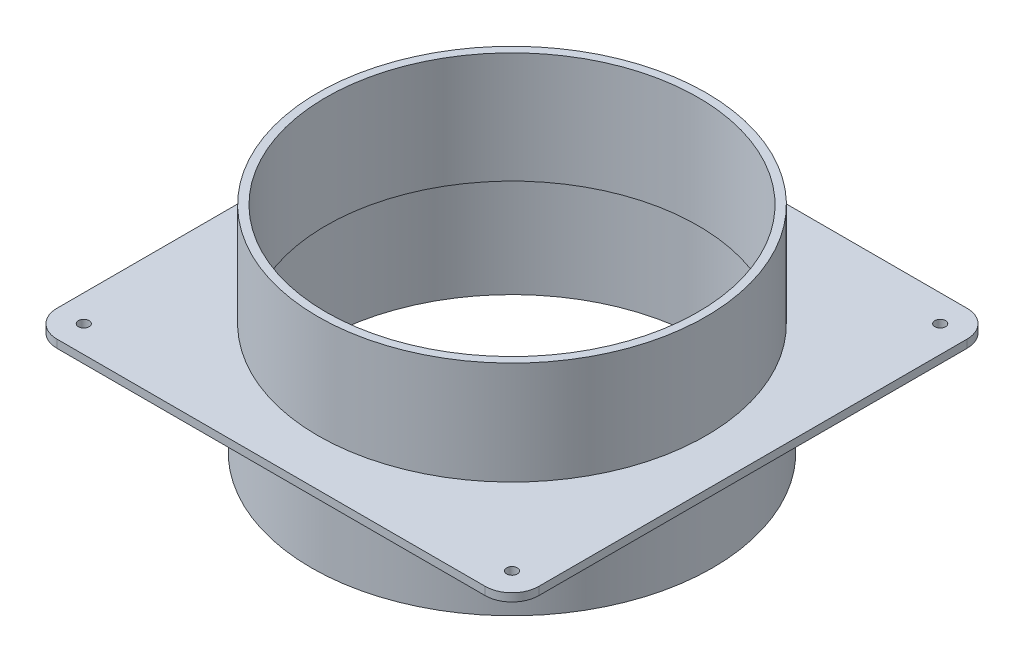
ISO-10303-21;
HEADER;
FILE_DESCRIPTION(('STEP AP214'),'2;1');
FILE_NAME('part.step','',(''),(''),'','','');
FILE_SCHEMA(('AUTOMOTIVE_DESIGN { 1 0 10303 214 1 1 1 1 }'));
ENDSEC;
DATA;
#1=APPLICATION_CONTEXT('core data for automotive mechanical design processes');
#2=APPLICATION_PROTOCOL_DEFINITION('international standard','automotive_design',2000,#1);
#3=PRODUCT_CONTEXT('',#1,'mechanical');
#4=PRODUCT('Part','Part','',(#3));
#5=PRODUCT_RELATED_PRODUCT_CATEGORY('part','',(#4));
#6=PRODUCT_DEFINITION_FORMATION('','',#4);
#7=PRODUCT_DEFINITION_CONTEXT('part definition',#1,'design');
#8=PRODUCT_DEFINITION('design','',#6,#7);
#9=PRODUCT_DEFINITION_SHAPE('','',#8);
#10=(LENGTH_UNIT() NAMED_UNIT(*) SI_UNIT(.MILLI.,.METRE.));
#11=(NAMED_UNIT(*) PLANE_ANGLE_UNIT() SI_UNIT($,.RADIAN.));
#12=(NAMED_UNIT(*) SI_UNIT($,.STERADIAN.) SOLID_ANGLE_UNIT());
#13=UNCERTAINTY_MEASURE_WITH_UNIT(LENGTH_MEASURE(1.E-05),#10,'distance_accuracy_value','');
#14=(GEOMETRIC_REPRESENTATION_CONTEXT(3) GLOBAL_UNCERTAINTY_ASSIGNED_CONTEXT((#13)) GLOBAL_UNIT_ASSIGNED_CONTEXT((#10,
#11,#12)) REPRESENTATION_CONTEXT('',''));
#15=CARTESIAN_POINT('',(0.,0.,0.));
#16=DIRECTION('',(0.,0.,1.));
#17=DIRECTION('',(1.,0.,0.));
#18=AXIS2_PLACEMENT_3D('',#15,#16,#17);
#19=CARTESIAN_POINT('',(0.,-40.,0.));
#20=DIRECTION('',(0.,1.,0.));
#21=DIRECTION('',(0.,0.,1.));
#22=AXIS2_PLACEMENT_3D('',#19,#20,#21);
#23=CYLINDRICAL_SURFACE('',#22,72.);
#24=CARTESIAN_POINT('',(0.,-40.,0.));
#25=DIRECTION('',(0.,1.,0.));
#26=DIRECTION('',(0.,0.,1.));
#27=AXIS2_PLACEMENT_3D('',#24,#25,#26);
#28=CIRCLE('',#27,72.);
#29=CARTESIAN_POINT('',(0.,-40.,72.));
#30=VERTEX_POINT('',#29);
#31=EDGE_CURVE('E19',#30,#30,#28,.F.);
#32=ORIENTED_EDGE('',*,*,#31,.T.);
#33=EDGE_LOOP('',(#32));
#34=FACE_BOUND('',#33,.T.);
#35=CARTESIAN_POINT('',(0.,-1.50000000000006,0.));
#36=DIRECTION('',(0.,1.,0.));
#37=DIRECTION('',(0.,0.,1.));
#38=AXIS2_PLACEMENT_3D('',#35,#36,#37);
#39=CIRCLE('',#38,72.);
#40=CARTESIAN_POINT('',(0.,-1.50000000000006,72.));
#41=VERTEX_POINT('',#40);
#42=EDGE_CURVE('E174',#41,#41,#39,.T.);
#43=ORIENTED_EDGE('',*,*,#42,.T.);
#44=EDGE_LOOP('',(#43));
#45=FACE_BOUND('',#44,.T.);
#46=ADVANCED_FACE('F16',(#34,#45),#23,.F.);
#47=CARTESIAN_POINT('',(0.,-40.,0.));
#48=DIRECTION('',(0.,1.,0.));
#49=DIRECTION('',(0.,0.,1.));
#50=AXIS2_PLACEMENT_3D('',#47,#48,#49);
#51=PLANE('',#50);
#52=CARTESIAN_POINT('',(0.,-40.,0.));
#53=DIRECTION('',(0.,1.,0.));
#54=DIRECTION('',(0.,0.,1.));
#55=AXIS2_PLACEMENT_3D('',#52,#53,#54);
#56=CIRCLE('',#55,75.);
#57=CARTESIAN_POINT('',(0.,-40.,75.));
#58=VERTEX_POINT('',#57);
#59=EDGE_CURVE('E172',#58,#58,#56,.T.);
#60=ORIENTED_EDGE('',*,*,#59,.F.);
#61=EDGE_LOOP('',(#60));
#62=FACE_BOUND('',#61,.T.);
#63=ORIENTED_EDGE('',*,*,#31,.F.);
#64=EDGE_LOOP('',(#63));
#65=FACE_BOUND('',#64,.T.);
#66=ADVANCED_FACE('F182',(#62,#65),#51,.F.);
#67=CARTESIAN_POINT('',(0.,-1.50000000000006,0.));
#68=DIRECTION('',(0.,1.,0.));
#69=DIRECTION('',(0.,0.,1.));
#70=AXIS2_PLACEMENT_3D('',#67,#68,#69);
#71=PLANE('',#70);
#72=ORIENTED_EDGE('',*,*,#42,.F.);
#73=EDGE_LOOP('',(#72));
#74=FACE_BOUND('',#73,.T.);
#75=CARTESIAN_POINT('',(0.,-1.50000000000006,0.));
#76=DIRECTION('',(0.,1.,0.));
#77=DIRECTION('',(0.,0.,1.));
#78=AXIS2_PLACEMENT_3D('',#75,#76,#77);
#79=CIRCLE('',#78,69.5);
#80=CARTESIAN_POINT('',(0.,-1.50000000000006,69.5));
#81=VERTEX_POINT('',#80);
#82=EDGE_CURVE('E169',#81,#81,#79,.T.);
#83=ORIENTED_EDGE('',*,*,#82,.T.);
#84=EDGE_LOOP('',(#83));
#85=FACE_BOUND('',#84,.T.);
#86=ADVANCED_FACE('F184',(#74,#85),#71,.F.);
#87=CARTESIAN_POINT('',(0.,-40.,0.));
#88=DIRECTION('',(0.,1.,0.));
#89=DIRECTION('',(0.,0.,1.));
#90=AXIS2_PLACEMENT_3D('',#87,#88,#89);
#91=CYLINDRICAL_SURFACE('',#90,75.);
#92=CARTESIAN_POINT('',(0.,-1.50000000000006,0.));
#93=DIRECTION('',(0.,1.,0.));
#94=DIRECTION('',(0.,0.,1.));
#95=AXIS2_PLACEMENT_3D('',#92,#93,#94);
#96=CIRCLE('',#95,75.);
#97=CARTESIAN_POINT('',(0.,-1.50000000000006,75.));
#98=VERTEX_POINT('',#97);
#99=EDGE_CURVE('E166',#98,#98,#96,.F.);
#100=ORIENTED_EDGE('',*,*,#99,.T.);
#101=EDGE_LOOP('',(#100));
#102=FACE_BOUND('',#101,.T.);
#103=ORIENTED_EDGE('',*,*,#59,.T.);
#104=EDGE_LOOP('',(#103));
#105=FACE_BOUND('',#104,.T.);
#106=ADVANCED_FACE('F191',(#102,#105),#91,.T.);
#107=CARTESIAN_POINT('',(0.,-1.50000000000006,0.));
#108=DIRECTION('',(0.,1.,0.));
#109=DIRECTION('',(0.,0.,1.));
#110=AXIS2_PLACEMENT_3D('',#107,#108,#109);
#111=CYLINDRICAL_SURFACE('',#110,69.5);
#112=CARTESIAN_POINT('',(0.,40.,0.));
#113=DIRECTION('',(0.,1.,0.));
#114=DIRECTION('',(0.,0.,1.));
#115=AXIS2_PLACEMENT_3D('',#112,#113,#114);
#116=CIRCLE('',#115,69.5);
#117=CARTESIAN_POINT('',(0.,40.,69.5));
#118=VERTEX_POINT('',#117);
#119=EDGE_CURVE('E91',#118,#118,#116,.F.);
#120=ORIENTED_EDGE('',*,*,#119,.F.);
#121=EDGE_LOOP('',(#120));
#122=FACE_BOUND('',#121,.T.);
#123=ORIENTED_EDGE('',*,*,#82,.F.);
#124=EDGE_LOOP('',(#123));
#125=FACE_BOUND('',#124,.T.);
#126=ADVANCED_FACE('F256',(#122,#125),#111,.F.);
#127=CARTESIAN_POINT('',(0.,-1.50000000000006,0.));
#128=DIRECTION('',(0.,1.,0.));
#129=DIRECTION('',(0.,0.,1.));
#130=AXIS2_PLACEMENT_3D('',#127,#128,#129);
#131=PLANE('',#130);
#132=DIRECTION('',(0.,0.,1.));
#133=VECTOR('',#132,1.);
#134=CARTESIAN_POINT('',(90.,-1.50000000000006,0.));
#135=LINE('',#134,#133);
#136=CARTESIAN_POINT('',(90.,-1.50000000000006,-80.));
#137=VERTEX_POINT('',#136);
#138=CARTESIAN_POINT('',(90.,-1.50000000000006,80.));
#139=VERTEX_POINT('',#138);
#140=EDGE_CURVE('E85',#137,#139,#135,.T.);
#141=ORIENTED_EDGE('',*,*,#140,.T.);
#142=CARTESIAN_POINT('',(80.,-1.50000000000006,80.));
#143=DIRECTION('',(0.,1.,0.));
#144=DIRECTION('',(0.,0.,1.));
#145=AXIS2_PLACEMENT_3D('',#142,#143,#144);
#146=CIRCLE('',#145,9.99999999999999);
#147=CARTESIAN_POINT('',(80.,-1.50000000000006,90.));
#148=VERTEX_POINT('',#147);
#149=EDGE_CURVE('E103',#148,#139,#146,.T.);
#150=ORIENTED_EDGE('',*,*,#149,.F.);
#151=DIRECTION('',(-1.,0.,0.));
#152=VECTOR('',#151,1.);
#153=CARTESIAN_POINT('',(0.,-1.50000000000006,90.));
#154=LINE('',#153,#152);
#155=CARTESIAN_POINT('',(-80.,-1.50000000000006,90.));
#156=VERTEX_POINT('',#155);
#157=EDGE_CURVE('E111',#148,#156,#154,.T.);
#158=ORIENTED_EDGE('',*,*,#157,.T.);
#159=CARTESIAN_POINT('',(-80.,-1.50000000000006,80.));
#160=DIRECTION('',(0.,1.,0.));
#161=DIRECTION('',(0.,0.,1.));
#162=AXIS2_PLACEMENT_3D('',#159,#160,#161);
#163=CIRCLE('',#162,9.99999999999999);
#164=CARTESIAN_POINT('',(-90.,-1.50000000000006,80.));
#165=VERTEX_POINT('',#164);
#166=EDGE_CURVE('E114',#165,#156,#163,.T.);
#167=ORIENTED_EDGE('',*,*,#166,.F.);
#168=DIRECTION('',(0.,0.,1.));
#169=VECTOR('',#168,1.);
#170=CARTESIAN_POINT('',(-90.,-1.50000000000006,0.));
#171=LINE('',#170,#169);
#172=CARTESIAN_POINT('',(-90.,-1.50000000000006,-79.9999999999999));
#173=VERTEX_POINT('',#172);
#174=EDGE_CURVE('E115',#173,#165,#171,.T.);
#175=ORIENTED_EDGE('',*,*,#174,.F.);
#176=CARTESIAN_POINT('',(-80.,-1.50000000000006,-80.));
#177=DIRECTION('',(0.,1.,0.));
#178=DIRECTION('',(0.,0.,1.));
#179=AXIS2_PLACEMENT_3D('',#176,#177,#178);
#180=CIRCLE('',#179,9.99999999999999);
#181=CARTESIAN_POINT('',(-80.,-1.50000000000006,-90.));
#182=VERTEX_POINT('',#181);
#183=EDGE_CURVE('E162',#182,#173,#180,.T.);
#184=ORIENTED_EDGE('',*,*,#183,.F.);
#185=DIRECTION('',(-1.,0.,0.));
#186=VECTOR('',#185,1.);
#187=CARTESIAN_POINT('',(0.,-1.50000000000006,-90.));
#188=LINE('',#187,#186);
#189=CARTESIAN_POINT('',(79.9999999999999,-1.50000000000006,-90.));
#190=VERTEX_POINT('',#189);
#191=EDGE_CURVE('E87',#190,#182,#188,.T.);
#192=ORIENTED_EDGE('',*,*,#191,.F.);
#193=CARTESIAN_POINT('',(80.,-1.50000000000006,-80.));
#194=DIRECTION('',(0.,1.,0.));
#195=DIRECTION('',(0.,0.,1.));
#196=AXIS2_PLACEMENT_3D('',#193,#194,#195);
#197=CIRCLE('',#196,9.99999999999999);
#198=EDGE_CURVE('E79',#137,#190,#197,.T.);
#199=ORIENTED_EDGE('',*,*,#198,.F.);
#200=EDGE_LOOP('',(#141,#150,#158,#167,#175,#184,#192,#199));
#201=FACE_BOUND('',#200,.T.);
#202=CARTESIAN_POINT('',(-80.,-1.50000000000006,80.));
#203=DIRECTION('',(0.,1.,0.));
#204=DIRECTION('',(0.,0.,1.));
#205=AXIS2_PLACEMENT_3D('',#202,#203,#204);
#206=CIRCLE('',#205,2.);
#207=CARTESIAN_POINT('',(-80.,-1.50000000000006,82.));
#208=VERTEX_POINT('',#207);
#209=EDGE_CURVE('E100',#208,#208,#206,.T.);
#210=ORIENTED_EDGE('',*,*,#209,.T.);
#211=EDGE_LOOP('',(#210));
#212=FACE_BOUND('',#211,.T.);
#213=CARTESIAN_POINT('',(80.,-1.50000000000006,80.));
#214=DIRECTION('',(0.,1.,0.));
#215=DIRECTION('',(0.,0.,1.));
#216=AXIS2_PLACEMENT_3D('',#213,#214,#215);
#217=CIRCLE('',#216,2.);
#218=CARTESIAN_POINT('',(80.,-1.50000000000006,82.));
#219=VERTEX_POINT('',#218);
#220=EDGE_CURVE('E155',#219,#219,#217,.T.);
#221=ORIENTED_EDGE('',*,*,#220,.T.);
#222=EDGE_LOOP('',(#221));
#223=FACE_BOUND('',#222,.T.);
#224=CARTESIAN_POINT('',(80.,-1.50000000000006,-79.9999999999999));
#225=DIRECTION('',(0.,1.,0.));
#226=DIRECTION('',(0.,0.,1.));
#227=AXIS2_PLACEMENT_3D('',#224,#225,#226);
#228=CIRCLE('',#227,2.);
#229=CARTESIAN_POINT('',(80.,-1.50000000000006,-77.9999999999999));
#230=VERTEX_POINT('',#229);
#231=EDGE_CURVE('E152',#230,#230,#228,.T.);
#232=ORIENTED_EDGE('',*,*,#231,.T.);
#233=EDGE_LOOP('',(#232));
#234=FACE_BOUND('',#233,.T.);
#235=CARTESIAN_POINT('',(-80.,-1.50000000000006,-80.));
#236=DIRECTION('',(0.,1.,0.));
#237=DIRECTION('',(0.,0.,1.));
#238=AXIS2_PLACEMENT_3D('',#235,#236,#237);
#239=CIRCLE('',#238,2.);
#240=CARTESIAN_POINT('',(-80.,-1.50000000000006,-78.));
#241=VERTEX_POINT('',#240);
#242=EDGE_CURVE('E149',#241,#241,#239,.T.);
#243=ORIENTED_EDGE('',*,*,#242,.T.);
#244=EDGE_LOOP('',(#243));
#245=FACE_BOUND('',#244,.T.);
#246=ORIENTED_EDGE('',*,*,#99,.F.);
#247=EDGE_LOOP('',(#246));
#248=FACE_BOUND('',#247,.T.);
#249=ADVANCED_FACE('F81',(#201,#212,#223,#234,#245,#248),#131,.F.);
#250=CARTESIAN_POINT('',(0.,40.,0.));
#251=DIRECTION('',(0.,1.,0.));
#252=DIRECTION('',(0.,0.,1.));
#253=AXIS2_PLACEMENT_3D('',#250,#251,#252);
#254=PLANE('',#253);
#255=ORIENTED_EDGE('',*,*,#119,.T.);
#256=EDGE_LOOP('',(#255));
#257=FACE_BOUND('',#256,.T.);
#258=CARTESIAN_POINT('',(0.,40.,0.));
#259=DIRECTION('',(0.,-1.,0.));
#260=DIRECTION('',(0.,0.,-1.));
#261=AXIS2_PLACEMENT_3D('',#258,#259,#260);
#262=CIRCLE('',#261,72.5);
#263=CARTESIAN_POINT('',(0.,40.,-72.5));
#264=VERTEX_POINT('',#263);
#265=EDGE_CURVE('E146',#264,#264,#262,.T.);
#266=ORIENTED_EDGE('',*,*,#265,.F.);
#267=EDGE_LOOP('',(#266));
#268=FACE_BOUND('',#267,.T.);
#269=ADVANCED_FACE('F250',(#257,#268),#254,.T.);
#270=CARTESIAN_POINT('',(80.,-1.50000000000006,-80.));
#271=DIRECTION('',(0.,1.,0.));
#272=DIRECTION('',(0.,0.,1.));
#273=AXIS2_PLACEMENT_3D('',#270,#271,#272);
#274=CYLINDRICAL_SURFACE('',#273,9.99999999999999);
#275=DIRECTION('',(0.,1.,0.));
#276=VECTOR('',#275,1.);
#277=CARTESIAN_POINT('',(90.,-1.50000000000006,-79.9999999999999));
#278=LINE('',#277,#276);
#279=CARTESIAN_POINT('',(90.,1.50000000000006,-80.));
#280=VERTEX_POINT('',#279);
#281=EDGE_CURVE('E94',#280,#137,#278,.F.);
#282=ORIENTED_EDGE('',*,*,#281,.T.);
#283=ORIENTED_EDGE('',*,*,#198,.T.);
#284=DIRECTION('',(0.,1.,0.));
#285=VECTOR('',#284,1.);
#286=CARTESIAN_POINT('',(79.9999999999999,-1.50000000000006,-90.));
#287=LINE('',#286,#285);
#288=CARTESIAN_POINT('',(79.9999999999999,1.50000000000006,-90.));
#289=VERTEX_POINT('',#288);
#290=EDGE_CURVE('E90',#289,#190,#287,.F.);
#291=ORIENTED_EDGE('',*,*,#290,.F.);
#292=CARTESIAN_POINT('',(80.,1.50000000000006,-80.));
#293=DIRECTION('',(0.,1.,0.));
#294=DIRECTION('',(0.,0.,1.));
#295=AXIS2_PLACEMENT_3D('',#292,#293,#294);
#296=CIRCLE('',#295,9.99999999999999);
#297=EDGE_CURVE('E97',#280,#289,#296,.T.);
#298=ORIENTED_EDGE('',*,*,#297,.F.);
#299=EDGE_LOOP('',(#282,#283,#291,#298));
#300=FACE_BOUND('',#299,.T.);
#301=ADVANCED_FACE('F95',(#300),#274,.T.);
#302=CARTESIAN_POINT('',(0.,-1.50000000000006,-90.));
#303=DIRECTION('',(0.,0.,-1.));
#304=DIRECTION('',(-1.,0.,0.));
#305=AXIS2_PLACEMENT_3D('',#302,#303,#304);
#306=PLANE('',#305);
#307=ORIENTED_EDGE('',*,*,#290,.T.);
#308=ORIENTED_EDGE('',*,*,#191,.T.);
#309=DIRECTION('',(0.,1.,0.));
#310=VECTOR('',#309,1.);
#311=CARTESIAN_POINT('',(-80.,-1.50000000000006,-90.));
#312=LINE('',#311,#310);
#313=CARTESIAN_POINT('',(-80.,1.50000000000006,-90.));
#314=VERTEX_POINT('',#313);
#315=EDGE_CURVE('E119',#314,#182,#312,.F.);
#316=ORIENTED_EDGE('',*,*,#315,.F.);
#317=DIRECTION('',(1.,0.,0.));
#318=VECTOR('',#317,1.);
#319=CARTESIAN_POINT('',(0.,1.50000000000006,-90.));
#320=LINE('',#319,#318);
#321=EDGE_CURVE('E144',#289,#314,#320,.F.);
#322=ORIENTED_EDGE('',*,*,#321,.F.);
#323=EDGE_LOOP('',(#307,#308,#316,#322));
#324=FACE_BOUND('',#323,.T.);
#325=ADVANCED_FACE('F243',(#324),#306,.T.);
#326=CARTESIAN_POINT('',(-80.,-1.50000000000006,-80.));
#327=DIRECTION('',(0.,1.,0.));
#328=DIRECTION('',(0.,0.,1.));
#329=AXIS2_PLACEMENT_3D('',#326,#327,#328);
#330=CYLINDRICAL_SURFACE('',#329,9.99999999999999);
#331=ORIENTED_EDGE('',*,*,#315,.T.);
#332=ORIENTED_EDGE('',*,*,#183,.T.);
#333=DIRECTION('',(0.,1.,0.));
#334=VECTOR('',#333,1.);
#335=CARTESIAN_POINT('',(-90.,-1.50000000000006,-79.9999999999999));
#336=LINE('',#335,#334);
#337=CARTESIAN_POINT('',(-90.,1.50000000000006,-79.9999999999999));
#338=VERTEX_POINT('',#337);
#339=EDGE_CURVE('E118',#338,#173,#336,.F.);
#340=ORIENTED_EDGE('',*,*,#339,.F.);
#341=CARTESIAN_POINT('',(-80.,1.50000000000006,-80.));
#342=DIRECTION('',(0.,1.,0.));
#343=DIRECTION('',(0.,0.,1.));
#344=AXIS2_PLACEMENT_3D('',#341,#342,#343);
#345=CIRCLE('',#344,9.99999999999999);
#346=EDGE_CURVE('E141',#314,#338,#345,.T.);
#347=ORIENTED_EDGE('',*,*,#346,.F.);
#348=EDGE_LOOP('',(#331,#332,#340,#347));
#349=FACE_BOUND('',#348,.T.);
#350=ADVANCED_FACE('F239',(#349),#330,.T.);
#351=CARTESIAN_POINT('',(-90.,-1.50000000000006,0.));
#352=DIRECTION('',(-1.,0.,0.));
#353=DIRECTION('',(0.,0.,1.));
#354=AXIS2_PLACEMENT_3D('',#351,#352,#353);
#355=PLANE('',#354);
#356=ORIENTED_EDGE('',*,*,#339,.T.);
#357=ORIENTED_EDGE('',*,*,#174,.T.);
#358=DIRECTION('',(0.,1.,0.));
#359=VECTOR('',#358,1.);
#360=CARTESIAN_POINT('',(-90.,-1.50000000000006,79.9999999999999));
#361=LINE('',#360,#359);
#362=CARTESIAN_POINT('',(-90.,1.50000000000006,80.));
#363=VERTEX_POINT('',#362);
#364=EDGE_CURVE('E117',#363,#165,#361,.F.);
#365=ORIENTED_EDGE('',*,*,#364,.F.);
#366=DIRECTION('',(0.,0.,1.));
#367=VECTOR('',#366,1.);
#368=CARTESIAN_POINT('',(-90.,1.50000000000006,0.));
#369=LINE('',#368,#367);
#370=EDGE_CURVE('E140',#338,#363,#369,.T.);
#371=ORIENTED_EDGE('',*,*,#370,.F.);
#372=EDGE_LOOP('',(#356,#357,#365,#371));
#373=FACE_BOUND('',#372,.T.);
#374=ADVANCED_FACE('F235',(#373),#355,.T.);
#375=CARTESIAN_POINT('',(-80.,-1.50000000000006,80.));
#376=DIRECTION('',(0.,1.,0.));
#377=DIRECTION('',(0.,0.,1.));
#378=AXIS2_PLACEMENT_3D('',#375,#376,#377);
#379=CYLINDRICAL_SURFACE('',#378,9.99999999999999);
#380=ORIENTED_EDGE('',*,*,#364,.T.);
#381=ORIENTED_EDGE('',*,*,#166,.T.);
#382=DIRECTION('',(0.,1.,0.));
#383=VECTOR('',#382,1.);
#384=CARTESIAN_POINT('',(-79.9999999999999,-1.50000000000006,90.));
#385=LINE('',#384,#383);
#386=CARTESIAN_POINT('',(-80.,1.50000000000006,90.));
#387=VERTEX_POINT('',#386);
#388=EDGE_CURVE('E113',#156,#387,#385,.T.);
#389=ORIENTED_EDGE('',*,*,#388,.T.);
#390=CARTESIAN_POINT('',(-80.,1.50000000000006,80.));
#391=DIRECTION('',(0.,1.,0.));
#392=DIRECTION('',(0.,0.,1.));
#393=AXIS2_PLACEMENT_3D('',#390,#391,#392);
#394=CIRCLE('',#393,9.99999999999999);
#395=EDGE_CURVE('E137',#363,#387,#394,.T.);
#396=ORIENTED_EDGE('',*,*,#395,.F.);
#397=EDGE_LOOP('',(#380,#381,#389,#396));
#398=FACE_BOUND('',#397,.T.);
#399=ADVANCED_FACE('F231',(#398),#379,.T.);
#400=CARTESIAN_POINT('',(0.,-1.50000000000006,90.));
#401=DIRECTION('',(0.,0.,-1.));
#402=DIRECTION('',(-1.,0.,0.));
#403=AXIS2_PLACEMENT_3D('',#400,#401,#402);
#404=PLANE('',#403);
#405=DIRECTION('',(1.,0.,0.));
#406=VECTOR('',#405,1.);
#407=CARTESIAN_POINT('',(0.,1.50000000000006,90.));
#408=LINE('',#407,#406);
#409=CARTESIAN_POINT('',(80.,1.50000000000006,90.));
#410=VERTEX_POINT('',#409);
#411=EDGE_CURVE('E136',#387,#410,#408,.T.);
#412=ORIENTED_EDGE('',*,*,#411,.F.);
#413=ORIENTED_EDGE('',*,*,#388,.F.);
#414=ORIENTED_EDGE('',*,*,#157,.F.);
#415=DIRECTION('',(0.,1.,0.));
#416=VECTOR('',#415,1.);
#417=CARTESIAN_POINT('',(80.,-1.50000000000006,90.));
#418=LINE('',#417,#416);
#419=EDGE_CURVE('E106',#410,#148,#418,.F.);
#420=ORIENTED_EDGE('',*,*,#419,.F.);
#421=EDGE_LOOP('',(#412,#413,#414,#420));
#422=FACE_BOUND('',#421,.T.);
#423=ADVANCED_FACE('F228',(#422),#404,.F.);
#424=CARTESIAN_POINT('',(80.,-1.50000000000006,80.));
#425=DIRECTION('',(0.,1.,0.));
#426=DIRECTION('',(0.,0.,1.));
#427=AXIS2_PLACEMENT_3D('',#424,#425,#426);
#428=CYLINDRICAL_SURFACE('',#427,9.99999999999999);
#429=ORIENTED_EDGE('',*,*,#419,.T.);
#430=ORIENTED_EDGE('',*,*,#149,.T.);
#431=DIRECTION('',(0.,1.,0.));
#432=VECTOR('',#431,1.);
#433=CARTESIAN_POINT('',(90.,-1.50000000000006,79.9999999999999));
#434=LINE('',#433,#432);
#435=CARTESIAN_POINT('',(90.,1.50000000000006,80.));
#436=VERTEX_POINT('',#435);
#437=EDGE_CURVE('E34',#139,#436,#434,.T.);
#438=ORIENTED_EDGE('',*,*,#437,.T.);
#439=CARTESIAN_POINT('',(80.,1.50000000000006,80.));
#440=DIRECTION('',(0.,1.,0.));
#441=DIRECTION('',(0.,0.,1.));
#442=AXIS2_PLACEMENT_3D('',#439,#440,#441);
#443=CIRCLE('',#442,9.99999999999999);
#444=EDGE_CURVE('E133',#410,#436,#443,.T.);
#445=ORIENTED_EDGE('',*,*,#444,.F.);
#446=EDGE_LOOP('',(#429,#430,#438,#445));
#447=FACE_BOUND('',#446,.T.);
#448=ADVANCED_FACE('F225',(#447),#428,.T.);
#449=CARTESIAN_POINT('',(90.,-1.50000000000006,0.));
#450=DIRECTION('',(-1.,0.,0.));
#451=DIRECTION('',(0.,0.,1.));
#452=AXIS2_PLACEMENT_3D('',#449,#450,#451);
#453=PLANE('',#452);
#454=DIRECTION('',(0.,0.,1.));
#455=VECTOR('',#454,1.);
#456=CARTESIAN_POINT('',(90.,1.50000000000006,0.));
#457=LINE('',#456,#455);
#458=EDGE_CURVE('E132',#436,#280,#457,.F.);
#459=ORIENTED_EDGE('',*,*,#458,.F.);
#460=ORIENTED_EDGE('',*,*,#437,.F.);
#461=ORIENTED_EDGE('',*,*,#140,.F.);
#462=ORIENTED_EDGE('',*,*,#281,.F.);
#463=EDGE_LOOP('',(#459,#460,#461,#462));
#464=FACE_BOUND('',#463,.T.);
#465=ADVANCED_FACE('F102',(#464),#453,.F.);
#466=CARTESIAN_POINT('',(-80.,-1.50000000000006,80.));
#467=DIRECTION('',(0.,1.,0.));
#468=DIRECTION('',(0.,0.,1.));
#469=AXIS2_PLACEMENT_3D('',#466,#467,#468);
#470=CYLINDRICAL_SURFACE('',#469,2.);
#471=CARTESIAN_POINT('',(-80.,1.50000000000006,80.));
#472=DIRECTION('',(0.,1.,0.));
#473=DIRECTION('',(0.,0.,1.));
#474=AXIS2_PLACEMENT_3D('',#471,#472,#473);
#475=CIRCLE('',#474,2.);
#476=CARTESIAN_POINT('',(-80.,1.50000000000006,82.));
#477=VERTEX_POINT('',#476);
#478=EDGE_CURVE('E129',#477,#477,#475,.F.);
#479=ORIENTED_EDGE('',*,*,#478,.F.);
#480=EDGE_LOOP('',(#479));
#481=FACE_BOUND('',#480,.T.);
#482=ORIENTED_EDGE('',*,*,#209,.F.);
#483=EDGE_LOOP('',(#482));
#484=FACE_BOUND('',#483,.T.);
#485=ADVANCED_FACE('F218',(#481,#484),#470,.F.);
#486=CARTESIAN_POINT('',(80.,-1.50000000000006,80.));
#487=DIRECTION('',(0.,1.,0.));
#488=DIRECTION('',(0.,0.,1.));
#489=AXIS2_PLACEMENT_3D('',#486,#487,#488);
#490=CYLINDRICAL_SURFACE('',#489,2.);
#491=CARTESIAN_POINT('',(80.,1.50000000000006,80.));
#492=DIRECTION('',(0.,1.,0.));
#493=DIRECTION('',(0.,0.,1.));
#494=AXIS2_PLACEMENT_3D('',#491,#492,#493);
#495=CIRCLE('',#494,2.);
#496=CARTESIAN_POINT('',(80.,1.50000000000006,82.));
#497=VERTEX_POINT('',#496);
#498=EDGE_CURVE('E126',#497,#497,#495,.F.);
#499=ORIENTED_EDGE('',*,*,#498,.F.);
#500=EDGE_LOOP('',(#499));
#501=FACE_BOUND('',#500,.T.);
#502=ORIENTED_EDGE('',*,*,#220,.F.);
#503=EDGE_LOOP('',(#502));
#504=FACE_BOUND('',#503,.T.);
#505=ADVANCED_FACE('F214',(#501,#504),#490,.F.);
#506=CARTESIAN_POINT('',(80.,-1.50000000000006,-79.9999999999999));
#507=DIRECTION('',(0.,1.,0.));
#508=DIRECTION('',(0.,0.,1.));
#509=AXIS2_PLACEMENT_3D('',#506,#507,#508);
#510=CYLINDRICAL_SURFACE('',#509,2.);
#511=CARTESIAN_POINT('',(80.,1.50000000000006,-79.9999999999999));
#512=DIRECTION('',(0.,1.,0.));
#513=DIRECTION('',(0.,0.,1.));
#514=AXIS2_PLACEMENT_3D('',#511,#512,#513);
#515=CIRCLE('',#514,2.);
#516=CARTESIAN_POINT('',(80.,1.50000000000006,-77.9999999999999));
#517=VERTEX_POINT('',#516);
#518=EDGE_CURVE('E123',#517,#517,#515,.F.);
#519=ORIENTED_EDGE('',*,*,#518,.F.);
#520=EDGE_LOOP('',(#519));
#521=FACE_BOUND('',#520,.T.);
#522=ORIENTED_EDGE('',*,*,#231,.F.);
#523=EDGE_LOOP('',(#522));
#524=FACE_BOUND('',#523,.T.);
#525=ADVANCED_FACE('F210',(#521,#524),#510,.F.);
#526=CARTESIAN_POINT('',(-80.,-1.50000000000006,-80.));
#527=DIRECTION('',(0.,1.,0.));
#528=DIRECTION('',(0.,0.,1.));
#529=AXIS2_PLACEMENT_3D('',#526,#527,#528);
#530=CYLINDRICAL_SURFACE('',#529,2.);
#531=CARTESIAN_POINT('',(-80.,1.50000000000006,-80.));
#532=DIRECTION('',(0.,1.,0.));
#533=DIRECTION('',(0.,0.,1.));
#534=AXIS2_PLACEMENT_3D('',#531,#532,#533);
#535=CIRCLE('',#534,2.);
#536=CARTESIAN_POINT('',(-80.,1.50000000000006,-78.));
#537=VERTEX_POINT('',#536);
#538=EDGE_CURVE('E25',#537,#537,#535,.F.);
#539=ORIENTED_EDGE('',*,*,#538,.F.);
#540=EDGE_LOOP('',(#539));
#541=FACE_BOUND('',#540,.T.);
#542=ORIENTED_EDGE('',*,*,#242,.F.);
#543=EDGE_LOOP('',(#542));
#544=FACE_BOUND('',#543,.T.);
#545=ADVANCED_FACE('F203',(#541,#544),#530,.F.);
#546=CARTESIAN_POINT('',(0.,40.,0.));
#547=DIRECTION('',(0.,-1.,0.));
#548=DIRECTION('',(0.,0.,-1.));
#549=AXIS2_PLACEMENT_3D('',#546,#547,#548);
#550=CYLINDRICAL_SURFACE('',#549,72.5);
#551=ORIENTED_EDGE('',*,*,#265,.T.);
#552=EDGE_LOOP('',(#551));
#553=FACE_BOUND('',#552,.T.);
#554=CARTESIAN_POINT('',(0.,1.50000000000006,0.));
#555=DIRECTION('',(0.,-1.,0.));
#556=DIRECTION('',(0.,0.,-1.));
#557=AXIS2_PLACEMENT_3D('',#554,#555,#556);
#558=CIRCLE('',#557,72.5);
#559=CARTESIAN_POINT('',(0.,1.50000000000006,-72.5));
#560=VERTEX_POINT('',#559);
#561=EDGE_CURVE('E10',#560,#560,#558,.T.);
#562=ORIENTED_EDGE('',*,*,#561,.F.);
#563=EDGE_LOOP('',(#562));
#564=FACE_BOUND('',#563,.T.);
#565=ADVANCED_FACE('F197',(#553,#564),#550,.T.);
#566=CARTESIAN_POINT('',(0.,1.50000000000006,0.));
#567=DIRECTION('',(0.,1.,0.));
#568=DIRECTION('',(0.,0.,1.));
#569=AXIS2_PLACEMENT_3D('',#566,#567,#568);
#570=PLANE('',#569);
#571=ORIENTED_EDGE('',*,*,#561,.T.);
#572=EDGE_LOOP('',(#571));
#573=FACE_BOUND('',#572,.T.);
#574=ORIENTED_EDGE('',*,*,#538,.T.);
#575=EDGE_LOOP('',(#574));
#576=FACE_BOUND('',#575,.T.);
#577=ORIENTED_EDGE('',*,*,#518,.T.);
#578=EDGE_LOOP('',(#577));
#579=FACE_BOUND('',#578,.T.);
#580=ORIENTED_EDGE('',*,*,#498,.T.);
#581=EDGE_LOOP('',(#580));
#582=FACE_BOUND('',#581,.T.);
#583=ORIENTED_EDGE('',*,*,#478,.T.);
#584=EDGE_LOOP('',(#583));
#585=FACE_BOUND('',#584,.T.);
#586=ORIENTED_EDGE('',*,*,#444,.T.);
#587=ORIENTED_EDGE('',*,*,#458,.T.);
#588=ORIENTED_EDGE('',*,*,#297,.T.);
#589=ORIENTED_EDGE('',*,*,#321,.T.);
#590=ORIENTED_EDGE('',*,*,#346,.T.);
#591=ORIENTED_EDGE('',*,*,#370,.T.);
#592=ORIENTED_EDGE('',*,*,#395,.T.);
#593=ORIENTED_EDGE('',*,*,#411,.T.);
#594=EDGE_LOOP('',(#586,#587,#588,#589,#590,#591,#592,#593));
#595=FACE_BOUND('',#594,.T.);
#596=ADVANCED_FACE('F195',(#573,#576,#579,#582,#585,#595),#570,.T.);
#597=CLOSED_SHELL('',(#46,#66,#86,#106,#126,#249,#269,#301,#325,#350,#374,#399,#423,#448,#465,
#485,#505,#525,#545,#565,#596));
#598=MANIFOLD_SOLID_BREP('B1',#597);
#599=ADVANCED_BREP_SHAPE_REPRESENTATION('',(#18,#598),#14);
#600=SHAPE_DEFINITION_REPRESENTATION(#9,#599);
ENDSEC;
END-ISO-10303-21;
